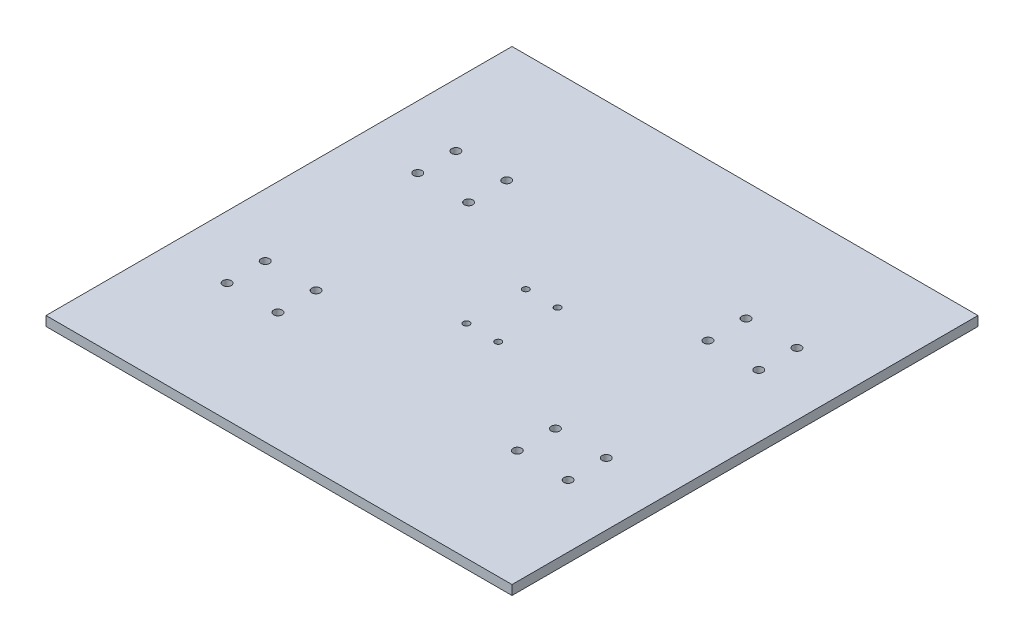
ISO-10303-21;
HEADER;
FILE_DESCRIPTION(('STEP AP214'),'2;1');
FILE_NAME('part.step','',(''),(''),'','','');
FILE_SCHEMA(('AUTOMOTIVE_DESIGN { 1 0 10303 214 1 1 1 1 }'));
ENDSEC;
DATA;
#1=APPLICATION_CONTEXT('core data for automotive mechanical design processes');
#2=APPLICATION_PROTOCOL_DEFINITION('international standard','automotive_design',2000,#1);
#3=PRODUCT_CONTEXT('',#1,'mechanical');
#4=PRODUCT('Part','Part','',(#3));
#5=PRODUCT_RELATED_PRODUCT_CATEGORY('part','',(#4));
#6=PRODUCT_DEFINITION_FORMATION('','',#4);
#7=PRODUCT_DEFINITION_CONTEXT('part definition',#1,'design');
#8=PRODUCT_DEFINITION('design','',#6,#7);
#9=PRODUCT_DEFINITION_SHAPE('','',#8);
#10=(LENGTH_UNIT() NAMED_UNIT(*) SI_UNIT(.MILLI.,.METRE.));
#11=(NAMED_UNIT(*) PLANE_ANGLE_UNIT() SI_UNIT($,.RADIAN.));
#12=(NAMED_UNIT(*) SI_UNIT($,.STERADIAN.) SOLID_ANGLE_UNIT());
#13=UNCERTAINTY_MEASURE_WITH_UNIT(LENGTH_MEASURE(1.E-05),#10,'distance_accuracy_value','');
#14=(GEOMETRIC_REPRESENTATION_CONTEXT(3) GLOBAL_UNCERTAINTY_ASSIGNED_CONTEXT((#13)) GLOBAL_UNIT_ASSIGNED_CONTEXT((#10,
#11,#12)) REPRESENTATION_CONTEXT('',''));
#15=CARTESIAN_POINT('',(0.,0.,0.));
#16=DIRECTION('',(0.,0.,1.));
#17=DIRECTION('',(1.,0.,0.));
#18=AXIS2_PLACEMENT_3D('',#15,#16,#17);
#19=CARTESIAN_POINT('',(0.,4.5,0.));
#20=DIRECTION('',(0.,1.,0.));
#21=DIRECTION('',(0.,0.,1.));
#22=AXIS2_PLACEMENT_3D('',#19,#20,#21);
#23=PLANE('',#22);
#24=CARTESIAN_POINT('',(56.5,4.5,-54.));
#25=DIRECTION('',(0.,1.,0.));
#26=DIRECTION('',(0.,0.,1.));
#27=AXIS2_PLACEMENT_3D('',#24,#25,#26);
#28=CIRCLE('',#27,2.);
#29=CARTESIAN_POINT('',(56.5,4.5,-52.));
#30=VERTEX_POINT('',#29);
#31=EDGE_CURVE('E220',#30,#30,#28,.F.);
#32=ORIENTED_EDGE('',*,*,#31,.T.);
#33=EDGE_LOOP('',(#32));
#34=FACE_BOUND('',#33,.T.);
#35=CARTESIAN_POINT('',(80.5,4.5,-54.));
#36=DIRECTION('',(0.,1.,0.));
#37=DIRECTION('',(0.,0.,1.));
#38=AXIS2_PLACEMENT_3D('',#35,#36,#37);
#39=CIRCLE('',#38,2.);
#40=CARTESIAN_POINT('',(80.5,4.5,-52.));
#41=VERTEX_POINT('',#40);
#42=EDGE_CURVE('E214',#41,#41,#39,.T.);
#43=ORIENTED_EDGE('',*,*,#42,.F.);
#44=EDGE_LOOP('',(#43));
#45=FACE_BOUND('',#44,.T.);
#46=CARTESIAN_POINT('',(80.5,4.5,-36.));
#47=DIRECTION('',(0.,1.,0.));
#48=DIRECTION('',(0.,0.,1.));
#49=AXIS2_PLACEMENT_3D('',#46,#47,#48);
#50=CIRCLE('',#49,2.);
#51=CARTESIAN_POINT('',(80.5,4.5,-34.));
#52=VERTEX_POINT('',#51);
#53=EDGE_CURVE('E208',#52,#52,#50,.T.);
#54=ORIENTED_EDGE('',*,*,#53,.F.);
#55=EDGE_LOOP('',(#54));
#56=FACE_BOUND('',#55,.T.);
#57=CARTESIAN_POINT('',(80.5,4.5,36.));
#58=DIRECTION('',(0.,1.,0.));
#59=DIRECTION('',(0.,0.,1.));
#60=AXIS2_PLACEMENT_3D('',#57,#58,#59);
#61=CIRCLE('',#60,1.99999999999999);
#62=CARTESIAN_POINT('',(80.5,4.5,38.));
#63=VERTEX_POINT('',#62);
#64=EDGE_CURVE('E202',#63,#63,#61,.T.);
#65=ORIENTED_EDGE('',*,*,#64,.F.);
#66=EDGE_LOOP('',(#65));
#67=FACE_BOUND('',#66,.T.);
#68=CARTESIAN_POINT('',(80.5,4.5,54.));
#69=DIRECTION('',(0.,1.,0.));
#70=DIRECTION('',(0.,0.,1.));
#71=AXIS2_PLACEMENT_3D('',#68,#69,#70);
#72=CIRCLE('',#71,1.99999999999999);
#73=CARTESIAN_POINT('',(80.5,4.5,56.));
#74=VERTEX_POINT('',#73);
#75=EDGE_CURVE('E196',#74,#74,#72,.T.);
#76=ORIENTED_EDGE('',*,*,#75,.F.);
#77=EDGE_LOOP('',(#76));
#78=FACE_BOUND('',#77,.T.);
#79=CARTESIAN_POINT('',(56.5,4.5,36.));
#80=DIRECTION('',(0.,1.,0.));
#81=DIRECTION('',(0.,0.,1.));
#82=AXIS2_PLACEMENT_3D('',#79,#80,#81);
#83=CIRCLE('',#82,2.);
#84=CARTESIAN_POINT('',(56.5,4.5,38.));
#85=VERTEX_POINT('',#84);
#86=EDGE_CURVE('E184',#85,#85,#83,.F.);
#87=ORIENTED_EDGE('',*,*,#86,.T.);
#88=EDGE_LOOP('',(#87));
#89=FACE_BOUND('',#88,.T.);
#90=CARTESIAN_POINT('',(-80.5,4.5,54.));
#91=DIRECTION('',(0.,1.,0.));
#92=DIRECTION('',(0.,0.,1.));
#93=AXIS2_PLACEMENT_3D('',#90,#91,#92);
#94=CIRCLE('',#93,1.99999999999999);
#95=CARTESIAN_POINT('',(-80.5,4.5,56.));
#96=VERTEX_POINT('',#95);
#97=EDGE_CURVE('E172',#96,#96,#94,.F.);
#98=ORIENTED_EDGE('',*,*,#97,.T.);
#99=EDGE_LOOP('',(#98));
#100=FACE_BOUND('',#99,.T.);
#101=CARTESIAN_POINT('',(-56.5000000000001,4.5,54.));
#102=DIRECTION('',(0.,1.,0.));
#103=DIRECTION('',(0.,0.,1.));
#104=AXIS2_PLACEMENT_3D('',#101,#102,#103);
#105=CIRCLE('',#104,2.);
#106=CARTESIAN_POINT('',(-56.5000000000001,4.5,56.));
#107=VERTEX_POINT('',#106);
#108=EDGE_CURVE('E166',#107,#107,#105,.T.);
#109=ORIENTED_EDGE('',*,*,#108,.F.);
#110=EDGE_LOOP('',(#109));
#111=FACE_BOUND('',#110,.T.);
#112=CARTESIAN_POINT('',(-56.5000000000001,4.5,36.));
#113=DIRECTION('',(0.,1.,0.));
#114=DIRECTION('',(0.,0.,1.));
#115=AXIS2_PLACEMENT_3D('',#112,#113,#114);
#116=CIRCLE('',#115,1.99999999999999);
#117=CARTESIAN_POINT('',(-56.5000000000001,4.5,38.));
#118=VERTEX_POINT('',#117);
#119=EDGE_CURVE('E160',#118,#118,#116,.T.);
#120=ORIENTED_EDGE('',*,*,#119,.F.);
#121=EDGE_LOOP('',(#120));
#122=FACE_BOUND('',#121,.T.);
#123=CARTESIAN_POINT('',(-56.5000000000001,4.5,-54.));
#124=DIRECTION('',(0.,1.,0.));
#125=DIRECTION('',(0.,0.,1.));
#126=AXIS2_PLACEMENT_3D('',#123,#124,#125);
#127=CIRCLE('',#126,2.);
#128=CARTESIAN_POINT('',(-56.5000000000001,4.5,-52.));
#129=VERTEX_POINT('',#128);
#130=EDGE_CURVE('E154',#129,#129,#127,.T.);
#131=ORIENTED_EDGE('',*,*,#130,.F.);
#132=EDGE_LOOP('',(#131));
#133=FACE_BOUND('',#132,.T.);
#134=CARTESIAN_POINT('',(-56.5000000000001,4.5,-36.));
#135=DIRECTION('',(0.,1.,0.));
#136=DIRECTION('',(0.,0.,1.));
#137=AXIS2_PLACEMENT_3D('',#134,#135,#136);
#138=CIRCLE('',#137,2.);
#139=CARTESIAN_POINT('',(-56.5000000000001,4.5,-34.));
#140=VERTEX_POINT('',#139);
#141=EDGE_CURVE('E148',#140,#140,#138,.T.);
#142=ORIENTED_EDGE('',*,*,#141,.F.);
#143=EDGE_LOOP('',(#142));
#144=FACE_BOUND('',#143,.T.);
#145=CARTESIAN_POINT('',(-80.5000000000001,4.5,-54.));
#146=DIRECTION('',(0.,1.,0.));
#147=DIRECTION('',(0.,0.,1.));
#148=AXIS2_PLACEMENT_3D('',#145,#146,#147);
#149=CIRCLE('',#148,2.);
#150=CARTESIAN_POINT('',(-80.5000000000001,4.5,-52.));
#151=VERTEX_POINT('',#150);
#152=EDGE_CURVE('E136',#151,#151,#149,.F.);
#153=ORIENTED_EDGE('',*,*,#152,.T.);
#154=EDGE_LOOP('',(#153));
#155=FACE_BOUND('',#154,.T.);
#156=CARTESIAN_POINT('',(7.50000000000001,4.5,-14.));
#157=DIRECTION('',(0.,1.,0.));
#158=DIRECTION('',(0.,0.,1.));
#159=AXIS2_PLACEMENT_3D('',#156,#157,#158);
#160=CIRCLE('',#159,1.5);
#161=CARTESIAN_POINT('',(7.50000000000001,4.5,-12.5));
#162=VERTEX_POINT('',#161);
#163=EDGE_CURVE('E118',#162,#162,#160,.F.);
#164=ORIENTED_EDGE('',*,*,#163,.T.);
#165=EDGE_LOOP('',(#164));
#166=FACE_BOUND('',#165,.T.);
#167=CARTESIAN_POINT('',(-7.49999999999999,4.5,-14.));
#168=DIRECTION('',(0.,1.,0.));
#169=DIRECTION('',(0.,0.,1.));
#170=AXIS2_PLACEMENT_3D('',#167,#168,#169);
#171=CIRCLE('',#170,1.5);
#172=CARTESIAN_POINT('',(-7.49999999999999,4.5,-12.5));
#173=VERTEX_POINT('',#172);
#174=EDGE_CURVE('E112',#173,#173,#171,.T.);
#175=ORIENTED_EDGE('',*,*,#174,.F.);
#176=EDGE_LOOP('',(#175));
#177=FACE_BOUND('',#176,.T.);
#178=DIRECTION('',(0.,0.,-1.));
#179=VECTOR('',#178,1.);
#180=CARTESIAN_POINT('',(110.,4.5,-110.));
#181=LINE('',#180,#179);
#182=CARTESIAN_POINT('',(110.,4.5,110.));
#183=VERTEX_POINT('',#182);
#184=CARTESIAN_POINT('',(110.,4.5,-110.));
#185=VERTEX_POINT('',#184);
#186=EDGE_CURVE('E85',#183,#185,#181,.T.);
#187=ORIENTED_EDGE('',*,*,#186,.T.);
#188=DIRECTION('',(-1.,0.,0.));
#189=VECTOR('',#188,1.);
#190=CARTESIAN_POINT('',(-110.,4.5,-110.));
#191=LINE('',#190,#189);
#192=CARTESIAN_POINT('',(-110.,4.5,-110.));
#193=VERTEX_POINT('',#192);
#194=EDGE_CURVE('E80',#185,#193,#191,.T.);
#195=ORIENTED_EDGE('',*,*,#194,.T.);
#196=DIRECTION('',(0.,0.,1.));
#197=VECTOR('',#196,1.);
#198=CARTESIAN_POINT('',(-110.,4.5,-110.));
#199=LINE('',#198,#197);
#200=CARTESIAN_POINT('',(-110.,4.5,110.));
#201=VERTEX_POINT('',#200);
#202=EDGE_CURVE('E83',#193,#201,#199,.T.);
#203=ORIENTED_EDGE('',*,*,#202,.T.);
#204=DIRECTION('',(1.,0.,0.));
#205=VECTOR('',#204,1.);
#206=CARTESIAN_POINT('',(-110.,4.5,110.));
#207=LINE('',#206,#205);
#208=EDGE_CURVE('E50',#201,#183,#207,.T.);
#209=ORIENTED_EDGE('',*,*,#208,.T.);
#210=EDGE_LOOP('',(#187,#195,#203,#209));
#211=FACE_BOUND('',#210,.T.);
#212=CARTESIAN_POINT('',(7.50000000000001,4.5,14.));
#213=DIRECTION('',(0.,1.,0.));
#214=DIRECTION('',(0.,0.,1.));
#215=AXIS2_PLACEMENT_3D('',#212,#213,#214);
#216=CIRCLE('',#215,1.5);
#217=CARTESIAN_POINT('',(7.50000000000001,4.5,15.5));
#218=VERTEX_POINT('',#217);
#219=EDGE_CURVE('E124',#218,#218,#216,.T.);
#220=ORIENTED_EDGE('',*,*,#219,.F.);
#221=EDGE_LOOP('',(#220));
#222=FACE_BOUND('',#221,.T.);
#223=CARTESIAN_POINT('',(-7.49999999999998,4.5,14.));
#224=DIRECTION('',(0.,1.,0.));
#225=DIRECTION('',(0.,0.,1.));
#226=AXIS2_PLACEMENT_3D('',#223,#224,#225);
#227=CIRCLE('',#226,1.5);
#228=CARTESIAN_POINT('',(-7.49999999999998,4.5,15.5));
#229=VERTEX_POINT('',#228);
#230=EDGE_CURVE('E130',#229,#229,#227,.F.);
#231=ORIENTED_EDGE('',*,*,#230,.T.);
#232=EDGE_LOOP('',(#231));
#233=FACE_BOUND('',#232,.T.);
#234=CARTESIAN_POINT('',(-80.5000000000001,4.5,-36.));
#235=DIRECTION('',(0.,1.,0.));
#236=DIRECTION('',(0.,0.,1.));
#237=AXIS2_PLACEMENT_3D('',#234,#235,#236);
#238=CIRCLE('',#237,2.);
#239=CARTESIAN_POINT('',(-80.5000000000001,4.5,-34.));
#240=VERTEX_POINT('',#239);
#241=EDGE_CURVE('E142',#240,#240,#238,.F.);
#242=ORIENTED_EDGE('',*,*,#241,.T.);
#243=EDGE_LOOP('',(#242));
#244=FACE_BOUND('',#243,.T.);
#245=CARTESIAN_POINT('',(-80.5000000000001,4.5,36.));
#246=DIRECTION('',(0.,1.,0.));
#247=DIRECTION('',(0.,0.,1.));
#248=AXIS2_PLACEMENT_3D('',#245,#246,#247);
#249=CIRCLE('',#248,1.99999999999999);
#250=CARTESIAN_POINT('',(-80.5000000000001,4.5,38.));
#251=VERTEX_POINT('',#250);
#252=EDGE_CURVE('E178',#251,#251,#249,.F.);
#253=ORIENTED_EDGE('',*,*,#252,.T.);
#254=EDGE_LOOP('',(#253));
#255=FACE_BOUND('',#254,.T.);
#256=CARTESIAN_POINT('',(56.5,4.5,54.));
#257=DIRECTION('',(0.,1.,0.));
#258=DIRECTION('',(0.,0.,1.));
#259=AXIS2_PLACEMENT_3D('',#256,#257,#258);
#260=CIRCLE('',#259,1.99999999999999);
#261=CARTESIAN_POINT('',(56.5,4.5,56.));
#262=VERTEX_POINT('',#261);
#263=EDGE_CURVE('E190',#262,#262,#260,.F.);
#264=ORIENTED_EDGE('',*,*,#263,.T.);
#265=EDGE_LOOP('',(#264));
#266=FACE_BOUND('',#265,.T.);
#267=CARTESIAN_POINT('',(56.5,4.5,-36.));
#268=DIRECTION('',(0.,1.,0.));
#269=DIRECTION('',(0.,0.,1.));
#270=AXIS2_PLACEMENT_3D('',#267,#268,#269);
#271=CIRCLE('',#270,2.);
#272=CARTESIAN_POINT('',(56.5,4.5,-34.));
#273=VERTEX_POINT('',#272);
#274=EDGE_CURVE('E226',#273,#273,#271,.F.);
#275=ORIENTED_EDGE('',*,*,#274,.T.);
#276=EDGE_LOOP('',(#275));
#277=FACE_BOUND('',#276,.T.);
#278=ADVANCED_FACE('F33',(#34,#45,#56,#67,#78,#89,#100,#111,#122,#133,#144,#155,#166,#177,#211,
#222,#233,#244,#255,#266,#277),#23,.T.);
#279=CARTESIAN_POINT('',(0.,0.,0.));
#280=DIRECTION('',(0.,1.,0.));
#281=DIRECTION('',(0.,0.,1.));
#282=AXIS2_PLACEMENT_3D('',#279,#280,#281);
#283=PLANE('',#282);
#284=CARTESIAN_POINT('',(56.5,0.,-54.));
#285=DIRECTION('',(0.,1.,0.));
#286=DIRECTION('',(0.,0.,1.));
#287=AXIS2_PLACEMENT_3D('',#284,#285,#286);
#288=CIRCLE('',#287,2.);
#289=CARTESIAN_POINT('',(56.5,0.,-52.));
#290=VERTEX_POINT('',#289);
#291=EDGE_CURVE('E217',#290,#290,#288,.F.);
#292=ORIENTED_EDGE('',*,*,#291,.F.);
#293=EDGE_LOOP('',(#292));
#294=FACE_BOUND('',#293,.T.);
#295=CARTESIAN_POINT('',(80.5,0.,-54.));
#296=DIRECTION('',(0.,1.,0.));
#297=DIRECTION('',(0.,0.,1.));
#298=AXIS2_PLACEMENT_3D('',#295,#296,#297);
#299=CIRCLE('',#298,2.);
#300=CARTESIAN_POINT('',(80.5,0.,-52.));
#301=VERTEX_POINT('',#300);
#302=EDGE_CURVE('E211',#301,#301,#299,.T.);
#303=ORIENTED_EDGE('',*,*,#302,.T.);
#304=EDGE_LOOP('',(#303));
#305=FACE_BOUND('',#304,.T.);
#306=CARTESIAN_POINT('',(80.5,0.,-36.));
#307=DIRECTION('',(0.,1.,0.));
#308=DIRECTION('',(0.,0.,1.));
#309=AXIS2_PLACEMENT_3D('',#306,#307,#308);
#310=CIRCLE('',#309,2.);
#311=CARTESIAN_POINT('',(80.5,0.,-34.));
#312=VERTEX_POINT('',#311);
#313=EDGE_CURVE('E205',#312,#312,#310,.T.);
#314=ORIENTED_EDGE('',*,*,#313,.T.);
#315=EDGE_LOOP('',(#314));
#316=FACE_BOUND('',#315,.T.);
#317=CARTESIAN_POINT('',(80.5,0.,36.));
#318=DIRECTION('',(0.,1.,0.));
#319=DIRECTION('',(0.,0.,1.));
#320=AXIS2_PLACEMENT_3D('',#317,#318,#319);
#321=CIRCLE('',#320,1.99999999999999);
#322=CARTESIAN_POINT('',(80.5,0.,38.));
#323=VERTEX_POINT('',#322);
#324=EDGE_CURVE('E199',#323,#323,#321,.T.);
#325=ORIENTED_EDGE('',*,*,#324,.T.);
#326=EDGE_LOOP('',(#325));
#327=FACE_BOUND('',#326,.T.);
#328=CARTESIAN_POINT('',(80.5,0.,54.));
#329=DIRECTION('',(0.,1.,0.));
#330=DIRECTION('',(0.,0.,1.));
#331=AXIS2_PLACEMENT_3D('',#328,#329,#330);
#332=CIRCLE('',#331,1.99999999999999);
#333=CARTESIAN_POINT('',(80.5,0.,56.));
#334=VERTEX_POINT('',#333);
#335=EDGE_CURVE('E193',#334,#334,#332,.T.);
#336=ORIENTED_EDGE('',*,*,#335,.T.);
#337=EDGE_LOOP('',(#336));
#338=FACE_BOUND('',#337,.T.);
#339=CARTESIAN_POINT('',(56.5,0.,36.));
#340=DIRECTION('',(0.,1.,0.));
#341=DIRECTION('',(0.,0.,1.));
#342=AXIS2_PLACEMENT_3D('',#339,#340,#341);
#343=CIRCLE('',#342,2.);
#344=CARTESIAN_POINT('',(56.5,0.,38.));
#345=VERTEX_POINT('',#344);
#346=EDGE_CURVE('E181',#345,#345,#343,.F.);
#347=ORIENTED_EDGE('',*,*,#346,.F.);
#348=EDGE_LOOP('',(#347));
#349=FACE_BOUND('',#348,.T.);
#350=CARTESIAN_POINT('',(-80.5,0.,54.));
#351=DIRECTION('',(0.,1.,0.));
#352=DIRECTION('',(0.,0.,1.));
#353=AXIS2_PLACEMENT_3D('',#350,#351,#352);
#354=CIRCLE('',#353,1.99999999999999);
#355=CARTESIAN_POINT('',(-80.5,0.,56.));
#356=VERTEX_POINT('',#355);
#357=EDGE_CURVE('E169',#356,#356,#354,.F.);
#358=ORIENTED_EDGE('',*,*,#357,.F.);
#359=EDGE_LOOP('',(#358));
#360=FACE_BOUND('',#359,.T.);
#361=CARTESIAN_POINT('',(-56.5000000000001,0.,54.));
#362=DIRECTION('',(0.,1.,0.));
#363=DIRECTION('',(0.,0.,1.));
#364=AXIS2_PLACEMENT_3D('',#361,#362,#363);
#365=CIRCLE('',#364,2.);
#366=CARTESIAN_POINT('',(-56.5000000000001,0.,56.));
#367=VERTEX_POINT('',#366);
#368=EDGE_CURVE('E163',#367,#367,#365,.T.);
#369=ORIENTED_EDGE('',*,*,#368,.T.);
#370=EDGE_LOOP('',(#369));
#371=FACE_BOUND('',#370,.T.);
#372=CARTESIAN_POINT('',(-56.5000000000001,0.,36.));
#373=DIRECTION('',(0.,1.,0.));
#374=DIRECTION('',(0.,0.,1.));
#375=AXIS2_PLACEMENT_3D('',#372,#373,#374);
#376=CIRCLE('',#375,1.99999999999999);
#377=CARTESIAN_POINT('',(-56.5000000000001,0.,38.));
#378=VERTEX_POINT('',#377);
#379=EDGE_CURVE('E157',#378,#378,#376,.T.);
#380=ORIENTED_EDGE('',*,*,#379,.T.);
#381=EDGE_LOOP('',(#380));
#382=FACE_BOUND('',#381,.T.);
#383=CARTESIAN_POINT('',(-56.5000000000001,0.,-54.));
#384=DIRECTION('',(0.,1.,0.));
#385=DIRECTION('',(0.,0.,1.));
#386=AXIS2_PLACEMENT_3D('',#383,#384,#385);
#387=CIRCLE('',#386,2.);
#388=CARTESIAN_POINT('',(-56.5000000000001,0.,-52.));
#389=VERTEX_POINT('',#388);
#390=EDGE_CURVE('E151',#389,#389,#387,.T.);
#391=ORIENTED_EDGE('',*,*,#390,.T.);
#392=EDGE_LOOP('',(#391));
#393=FACE_BOUND('',#392,.T.);
#394=CARTESIAN_POINT('',(-56.5000000000001,0.,-36.));
#395=DIRECTION('',(0.,1.,0.));
#396=DIRECTION('',(0.,0.,1.));
#397=AXIS2_PLACEMENT_3D('',#394,#395,#396);
#398=CIRCLE('',#397,2.);
#399=CARTESIAN_POINT('',(-56.5000000000001,0.,-34.));
#400=VERTEX_POINT('',#399);
#401=EDGE_CURVE('E145',#400,#400,#398,.T.);
#402=ORIENTED_EDGE('',*,*,#401,.T.);
#403=EDGE_LOOP('',(#402));
#404=FACE_BOUND('',#403,.T.);
#405=CARTESIAN_POINT('',(-80.5000000000001,0.,-54.));
#406=DIRECTION('',(0.,1.,0.));
#407=DIRECTION('',(0.,0.,1.));
#408=AXIS2_PLACEMENT_3D('',#405,#406,#407);
#409=CIRCLE('',#408,2.);
#410=CARTESIAN_POINT('',(-80.5000000000001,0.,-52.));
#411=VERTEX_POINT('',#410);
#412=EDGE_CURVE('E133',#411,#411,#409,.F.);
#413=ORIENTED_EDGE('',*,*,#412,.F.);
#414=EDGE_LOOP('',(#413));
#415=FACE_BOUND('',#414,.T.);
#416=CARTESIAN_POINT('',(7.50000000000001,0.,-14.));
#417=DIRECTION('',(0.,1.,0.));
#418=DIRECTION('',(0.,0.,1.));
#419=AXIS2_PLACEMENT_3D('',#416,#417,#418);
#420=CIRCLE('',#419,1.5);
#421=CARTESIAN_POINT('',(7.50000000000001,0.,-12.5));
#422=VERTEX_POINT('',#421);
#423=EDGE_CURVE('E115',#422,#422,#420,.F.);
#424=ORIENTED_EDGE('',*,*,#423,.F.);
#425=EDGE_LOOP('',(#424));
#426=FACE_BOUND('',#425,.T.);
#427=CARTESIAN_POINT('',(-7.49999999999999,0.,-14.));
#428=DIRECTION('',(0.,1.,0.));
#429=DIRECTION('',(0.,0.,1.));
#430=AXIS2_PLACEMENT_3D('',#427,#428,#429);
#431=CIRCLE('',#430,1.5);
#432=CARTESIAN_POINT('',(-7.49999999999999,0.,-12.5));
#433=VERTEX_POINT('',#432);
#434=EDGE_CURVE('E100',#433,#433,#431,.T.);
#435=ORIENTED_EDGE('',*,*,#434,.T.);
#436=EDGE_LOOP('',(#435));
#437=FACE_BOUND('',#436,.T.);
#438=DIRECTION('',(0.,0.,-1.));
#439=VECTOR('',#438,1.);
#440=CARTESIAN_POINT('',(110.,0.,-110.));
#441=LINE('',#440,#439);
#442=CARTESIAN_POINT('',(110.,0.,110.));
#443=VERTEX_POINT('',#442);
#444=CARTESIAN_POINT('',(110.,0.,-110.));
#445=VERTEX_POINT('',#444);
#446=EDGE_CURVE('E97',#443,#445,#441,.T.);
#447=ORIENTED_EDGE('',*,*,#446,.F.);
#448=DIRECTION('',(1.,0.,0.));
#449=VECTOR('',#448,1.);
#450=CARTESIAN_POINT('',(-110.,0.,110.));
#451=LINE('',#450,#449);
#452=CARTESIAN_POINT('',(-110.,0.,110.));
#453=VERTEX_POINT('',#452);
#454=EDGE_CURVE('E73',#453,#443,#451,.T.);
#455=ORIENTED_EDGE('',*,*,#454,.F.);
#456=DIRECTION('',(0.,0.,1.));
#457=VECTOR('',#456,1.);
#458=CARTESIAN_POINT('',(-110.,0.,-110.));
#459=LINE('',#458,#457);
#460=CARTESIAN_POINT('',(-110.,0.,-110.));
#461=VERTEX_POINT('',#460);
#462=EDGE_CURVE('E67',#461,#453,#459,.T.);
#463=ORIENTED_EDGE('',*,*,#462,.F.);
#464=DIRECTION('',(-1.,0.,0.));
#465=VECTOR('',#464,1.);
#466=CARTESIAN_POINT('',(-110.,0.,-110.));
#467=LINE('',#466,#465);
#468=EDGE_CURVE('E89',#445,#461,#467,.T.);
#469=ORIENTED_EDGE('',*,*,#468,.F.);
#470=EDGE_LOOP('',(#447,#455,#463,#469));
#471=FACE_BOUND('',#470,.T.);
#472=CARTESIAN_POINT('',(7.50000000000001,0.,14.));
#473=DIRECTION('',(0.,1.,0.));
#474=DIRECTION('',(0.,0.,1.));
#475=AXIS2_PLACEMENT_3D('',#472,#473,#474);
#476=CIRCLE('',#475,1.5);
#477=CARTESIAN_POINT('',(7.50000000000001,0.,15.5));
#478=VERTEX_POINT('',#477);
#479=EDGE_CURVE('E121',#478,#478,#476,.T.);
#480=ORIENTED_EDGE('',*,*,#479,.T.);
#481=EDGE_LOOP('',(#480));
#482=FACE_BOUND('',#481,.T.);
#483=CARTESIAN_POINT('',(-7.49999999999998,0.,14.));
#484=DIRECTION('',(0.,1.,0.));
#485=DIRECTION('',(0.,0.,1.));
#486=AXIS2_PLACEMENT_3D('',#483,#484,#485);
#487=CIRCLE('',#486,1.5);
#488=CARTESIAN_POINT('',(-7.49999999999998,0.,15.5));
#489=VERTEX_POINT('',#488);
#490=EDGE_CURVE('E127',#489,#489,#487,.F.);
#491=ORIENTED_EDGE('',*,*,#490,.F.);
#492=EDGE_LOOP('',(#491));
#493=FACE_BOUND('',#492,.T.);
#494=CARTESIAN_POINT('',(-80.5000000000001,0.,-36.));
#495=DIRECTION('',(0.,1.,0.));
#496=DIRECTION('',(0.,0.,1.));
#497=AXIS2_PLACEMENT_3D('',#494,#495,#496);
#498=CIRCLE('',#497,2.);
#499=CARTESIAN_POINT('',(-80.5000000000001,0.,-34.));
#500=VERTEX_POINT('',#499);
#501=EDGE_CURVE('E139',#500,#500,#498,.F.);
#502=ORIENTED_EDGE('',*,*,#501,.F.);
#503=EDGE_LOOP('',(#502));
#504=FACE_BOUND('',#503,.T.);
#505=CARTESIAN_POINT('',(-80.5000000000001,0.,36.));
#506=DIRECTION('',(0.,1.,0.));
#507=DIRECTION('',(0.,0.,1.));
#508=AXIS2_PLACEMENT_3D('',#505,#506,#507);
#509=CIRCLE('',#508,1.99999999999999);
#510=CARTESIAN_POINT('',(-80.5000000000001,0.,38.));
#511=VERTEX_POINT('',#510);
#512=EDGE_CURVE('E175',#511,#511,#509,.F.);
#513=ORIENTED_EDGE('',*,*,#512,.F.);
#514=EDGE_LOOP('',(#513));
#515=FACE_BOUND('',#514,.T.);
#516=CARTESIAN_POINT('',(56.5,0.,54.));
#517=DIRECTION('',(0.,1.,0.));
#518=DIRECTION('',(0.,0.,1.));
#519=AXIS2_PLACEMENT_3D('',#516,#517,#518);
#520=CIRCLE('',#519,1.99999999999999);
#521=CARTESIAN_POINT('',(56.5,0.,56.));
#522=VERTEX_POINT('',#521);
#523=EDGE_CURVE('E187',#522,#522,#520,.F.);
#524=ORIENTED_EDGE('',*,*,#523,.F.);
#525=EDGE_LOOP('',(#524));
#526=FACE_BOUND('',#525,.T.);
#527=CARTESIAN_POINT('',(56.5,0.,-36.));
#528=DIRECTION('',(0.,1.,0.));
#529=DIRECTION('',(0.,0.,1.));
#530=AXIS2_PLACEMENT_3D('',#527,#528,#529);
#531=CIRCLE('',#530,2.);
#532=CARTESIAN_POINT('',(56.5,0.,-34.));
#533=VERTEX_POINT('',#532);
#534=EDGE_CURVE('E223',#533,#533,#531,.F.);
#535=ORIENTED_EDGE('',*,*,#534,.F.);
#536=EDGE_LOOP('',(#535));
#537=FACE_BOUND('',#536,.T.);
#538=ADVANCED_FACE('F108',(#294,#305,#316,#327,#338,#349,#360,#371,#382,#393,#404,#415,#426,
#437,#471,#482,#493,#504,#515,#526,#537),#283,.F.);
#539=CARTESIAN_POINT('',(110.,4.5,-110.));
#540=DIRECTION('',(-1.,0.,0.));
#541=DIRECTION('',(0.,0.,1.));
#542=AXIS2_PLACEMENT_3D('',#539,#540,#541);
#543=PLANE('',#542);
#544=ORIENTED_EDGE('',*,*,#446,.T.);
#545=DIRECTION('',(0.,-1.,0.));
#546=VECTOR('',#545,1.);
#547=CARTESIAN_POINT('',(110.,4.5,-110.));
#548=LINE('',#547,#546);
#549=EDGE_CURVE('E11',#185,#445,#548,.T.);
#550=ORIENTED_EDGE('',*,*,#549,.F.);
#551=ORIENTED_EDGE('',*,*,#186,.F.);
#552=DIRECTION('',(0.,-1.,0.));
#553=VECTOR('',#552,1.);
#554=CARTESIAN_POINT('',(110.,4.5,110.));
#555=LINE('',#554,#553);
#556=EDGE_CURVE('E93',#183,#443,#555,.T.);
#557=ORIENTED_EDGE('',*,*,#556,.T.);
#558=EDGE_LOOP('',(#544,#550,#551,#557));
#559=FACE_BOUND('',#558,.T.);
#560=ADVANCED_FACE('F35',(#559),#543,.F.);
#561=CARTESIAN_POINT('',(-110.,4.5,-110.));
#562=DIRECTION('',(0.,0.,1.));
#563=DIRECTION('',(1.,0.,0.));
#564=AXIS2_PLACEMENT_3D('',#561,#562,#563);
#565=PLANE('',#564);
#566=ORIENTED_EDGE('',*,*,#468,.T.);
#567=DIRECTION('',(0.,-1.,0.));
#568=VECTOR('',#567,1.);
#569=CARTESIAN_POINT('',(-110.,4.5,-110.));
#570=LINE('',#569,#568);
#571=EDGE_CURVE('E42',#193,#461,#570,.T.);
#572=ORIENTED_EDGE('',*,*,#571,.F.);
#573=ORIENTED_EDGE('',*,*,#194,.F.);
#574=ORIENTED_EDGE('',*,*,#549,.T.);
#575=EDGE_LOOP('',(#566,#572,#573,#574));
#576=FACE_BOUND('',#575,.T.);
#577=ADVANCED_FACE('F88',(#576),#565,.F.);
#578=CARTESIAN_POINT('',(-110.,4.5,-110.));
#579=DIRECTION('',(1.,0.,0.));
#580=DIRECTION('',(0.,0.,-1.));
#581=AXIS2_PLACEMENT_3D('',#578,#579,#580);
#582=PLANE('',#581);
#583=ORIENTED_EDGE('',*,*,#462,.T.);
#584=DIRECTION('',(0.,-1.,0.));
#585=VECTOR('',#584,1.);
#586=CARTESIAN_POINT('',(-110.,4.5,110.));
#587=LINE('',#586,#585);
#588=EDGE_CURVE('E90',#201,#453,#587,.T.);
#589=ORIENTED_EDGE('',*,*,#588,.F.);
#590=ORIENTED_EDGE('',*,*,#202,.F.);
#591=ORIENTED_EDGE('',*,*,#571,.T.);
#592=EDGE_LOOP('',(#583,#589,#590,#591));
#593=FACE_BOUND('',#592,.T.);
#594=ADVANCED_FACE('F91',(#593),#582,.F.);
#595=CARTESIAN_POINT('',(-110.,4.5,110.));
#596=DIRECTION('',(0.,0.,-1.));
#597=DIRECTION('',(-1.,0.,0.));
#598=AXIS2_PLACEMENT_3D('',#595,#596,#597);
#599=PLANE('',#598);
#600=ORIENTED_EDGE('',*,*,#454,.T.);
#601=ORIENTED_EDGE('',*,*,#556,.F.);
#602=ORIENTED_EDGE('',*,*,#208,.F.);
#603=ORIENTED_EDGE('',*,*,#588,.T.);
#604=EDGE_LOOP('',(#600,#601,#602,#603));
#605=FACE_BOUND('',#604,.T.);
#606=ADVANCED_FACE('F105',(#605),#599,.F.);
#607=CARTESIAN_POINT('',(-7.49999999999999,0.,-14.));
#608=DIRECTION('',(0.,1.,0.));
#609=DIRECTION('',(0.,0.,1.));
#610=AXIS2_PLACEMENT_3D('',#607,#608,#609);
#611=CYLINDRICAL_SURFACE('',#610,1.5);
#612=ORIENTED_EDGE('',*,*,#434,.F.);
#613=EDGE_LOOP('',(#612));
#614=FACE_BOUND('',#613,.T.);
#615=ORIENTED_EDGE('',*,*,#174,.T.);
#616=EDGE_LOOP('',(#615));
#617=FACE_BOUND('',#616,.T.);
#618=ADVANCED_FACE('F250',(#614,#617),#611,.F.);
#619=CARTESIAN_POINT('',(7.50000000000001,0.,-14.));
#620=DIRECTION('',(0.,1.,0.));
#621=DIRECTION('',(0.,0.,1.));
#622=AXIS2_PLACEMENT_3D('',#619,#620,#621);
#623=CYLINDRICAL_SURFACE('',#622,1.5);
#624=ORIENTED_EDGE('',*,*,#423,.T.);
#625=EDGE_LOOP('',(#624));
#626=FACE_BOUND('',#625,.T.);
#627=ORIENTED_EDGE('',*,*,#163,.F.);
#628=EDGE_LOOP('',(#627));
#629=FACE_BOUND('',#628,.T.);
#630=ADVANCED_FACE('F272',(#626,#629),#623,.F.);
#631=CARTESIAN_POINT('',(7.50000000000001,0.,14.));
#632=DIRECTION('',(0.,1.,0.));
#633=DIRECTION('',(0.,0.,1.));
#634=AXIS2_PLACEMENT_3D('',#631,#632,#633);
#635=CYLINDRICAL_SURFACE('',#634,1.5);
#636=ORIENTED_EDGE('',*,*,#479,.F.);
#637=EDGE_LOOP('',(#636));
#638=FACE_BOUND('',#637,.T.);
#639=ORIENTED_EDGE('',*,*,#219,.T.);
#640=EDGE_LOOP('',(#639));
#641=FACE_BOUND('',#640,.T.);
#642=ADVANCED_FACE('F279',(#638,#641),#635,.F.);
#643=CARTESIAN_POINT('',(-7.49999999999998,0.,14.));
#644=DIRECTION('',(0.,1.,0.));
#645=DIRECTION('',(0.,0.,1.));
#646=AXIS2_PLACEMENT_3D('',#643,#644,#645);
#647=CYLINDRICAL_SURFACE('',#646,1.5);
#648=ORIENTED_EDGE('',*,*,#490,.T.);
#649=EDGE_LOOP('',(#648));
#650=FACE_BOUND('',#649,.T.);
#651=ORIENTED_EDGE('',*,*,#230,.F.);
#652=EDGE_LOOP('',(#651));
#653=FACE_BOUND('',#652,.T.);
#654=ADVANCED_FACE('F287',(#650,#653),#647,.F.);
#655=CARTESIAN_POINT('',(-80.5000000000001,0.,-54.));
#656=DIRECTION('',(0.,1.,0.));
#657=DIRECTION('',(0.,0.,1.));
#658=AXIS2_PLACEMENT_3D('',#655,#656,#657);
#659=CYLINDRICAL_SURFACE('',#658,2.);
#660=ORIENTED_EDGE('',*,*,#412,.T.);
#661=EDGE_LOOP('',(#660));
#662=FACE_BOUND('',#661,.T.);
#663=ORIENTED_EDGE('',*,*,#152,.F.);
#664=EDGE_LOOP('',(#663));
#665=FACE_BOUND('',#664,.T.);
#666=ADVANCED_FACE('F295',(#662,#665),#659,.F.);
#667=CARTESIAN_POINT('',(-80.5000000000001,0.,-36.));
#668=DIRECTION('',(0.,1.,0.));
#669=DIRECTION('',(0.,0.,1.));
#670=AXIS2_PLACEMENT_3D('',#667,#668,#669);
#671=CYLINDRICAL_SURFACE('',#670,2.);
#672=ORIENTED_EDGE('',*,*,#501,.T.);
#673=EDGE_LOOP('',(#672));
#674=FACE_BOUND('',#673,.T.);
#675=ORIENTED_EDGE('',*,*,#241,.F.);
#676=EDGE_LOOP('',(#675));
#677=FACE_BOUND('',#676,.T.);
#678=ADVANCED_FACE('F303',(#674,#677),#671,.F.);
#679=CARTESIAN_POINT('',(-56.5000000000001,0.,-36.));
#680=DIRECTION('',(0.,1.,0.));
#681=DIRECTION('',(0.,0.,1.));
#682=AXIS2_PLACEMENT_3D('',#679,#680,#681);
#683=CYLINDRICAL_SURFACE('',#682,2.);
#684=ORIENTED_EDGE('',*,*,#401,.F.);
#685=EDGE_LOOP('',(#684));
#686=FACE_BOUND('',#685,.T.);
#687=ORIENTED_EDGE('',*,*,#141,.T.);
#688=EDGE_LOOP('',(#687));
#689=FACE_BOUND('',#688,.T.);
#690=ADVANCED_FACE('F311',(#686,#689),#683,.F.);
#691=CARTESIAN_POINT('',(-56.5000000000001,0.,-54.));
#692=DIRECTION('',(0.,1.,0.));
#693=DIRECTION('',(0.,0.,1.));
#694=AXIS2_PLACEMENT_3D('',#691,#692,#693);
#695=CYLINDRICAL_SURFACE('',#694,2.);
#696=ORIENTED_EDGE('',*,*,#390,.F.);
#697=EDGE_LOOP('',(#696));
#698=FACE_BOUND('',#697,.T.);
#699=ORIENTED_EDGE('',*,*,#130,.T.);
#700=EDGE_LOOP('',(#699));
#701=FACE_BOUND('',#700,.T.);
#702=ADVANCED_FACE('F319',(#698,#701),#695,.F.);
#703=CARTESIAN_POINT('',(-56.5000000000001,0.,36.));
#704=DIRECTION('',(0.,1.,0.));
#705=DIRECTION('',(0.,0.,1.));
#706=AXIS2_PLACEMENT_3D('',#703,#704,#705);
#707=CYLINDRICAL_SURFACE('',#706,1.99999999999999);
#708=ORIENTED_EDGE('',*,*,#379,.F.);
#709=EDGE_LOOP('',(#708));
#710=FACE_BOUND('',#709,.T.);
#711=ORIENTED_EDGE('',*,*,#119,.T.);
#712=EDGE_LOOP('',(#711));
#713=FACE_BOUND('',#712,.T.);
#714=ADVANCED_FACE('F327',(#710,#713),#707,.F.);
#715=CARTESIAN_POINT('',(-56.5000000000001,0.,54.));
#716=DIRECTION('',(0.,1.,0.));
#717=DIRECTION('',(0.,0.,1.));
#718=AXIS2_PLACEMENT_3D('',#715,#716,#717);
#719=CYLINDRICAL_SURFACE('',#718,2.);
#720=ORIENTED_EDGE('',*,*,#368,.F.);
#721=EDGE_LOOP('',(#720));
#722=FACE_BOUND('',#721,.T.);
#723=ORIENTED_EDGE('',*,*,#108,.T.);
#724=EDGE_LOOP('',(#723));
#725=FACE_BOUND('',#724,.T.);
#726=ADVANCED_FACE('F335',(#722,#725),#719,.F.);
#727=CARTESIAN_POINT('',(-80.5,0.,54.));
#728=DIRECTION('',(0.,1.,0.));
#729=DIRECTION('',(0.,0.,1.));
#730=AXIS2_PLACEMENT_3D('',#727,#728,#729);
#731=CYLINDRICAL_SURFACE('',#730,1.99999999999999);
#732=ORIENTED_EDGE('',*,*,#357,.T.);
#733=EDGE_LOOP('',(#732));
#734=FACE_BOUND('',#733,.T.);
#735=ORIENTED_EDGE('',*,*,#97,.F.);
#736=EDGE_LOOP('',(#735));
#737=FACE_BOUND('',#736,.T.);
#738=ADVANCED_FACE('F343',(#734,#737),#731,.F.);
#739=CARTESIAN_POINT('',(-80.5000000000001,0.,36.));
#740=DIRECTION('',(0.,1.,0.));
#741=DIRECTION('',(0.,0.,1.));
#742=AXIS2_PLACEMENT_3D('',#739,#740,#741);
#743=CYLINDRICAL_SURFACE('',#742,1.99999999999999);
#744=ORIENTED_EDGE('',*,*,#512,.T.);
#745=EDGE_LOOP('',(#744));
#746=FACE_BOUND('',#745,.T.);
#747=ORIENTED_EDGE('',*,*,#252,.F.);
#748=EDGE_LOOP('',(#747));
#749=FACE_BOUND('',#748,.T.);
#750=ADVANCED_FACE('F351',(#746,#749),#743,.F.);
#751=CARTESIAN_POINT('',(56.5,0.,36.));
#752=DIRECTION('',(0.,1.,0.));
#753=DIRECTION('',(0.,0.,1.));
#754=AXIS2_PLACEMENT_3D('',#751,#752,#753);
#755=CYLINDRICAL_SURFACE('',#754,2.);
#756=ORIENTED_EDGE('',*,*,#346,.T.);
#757=EDGE_LOOP('',(#756));
#758=FACE_BOUND('',#757,.T.);
#759=ORIENTED_EDGE('',*,*,#86,.F.);
#760=EDGE_LOOP('',(#759));
#761=FACE_BOUND('',#760,.T.);
#762=ADVANCED_FACE('F359',(#758,#761),#755,.F.);
#763=CARTESIAN_POINT('',(56.5,0.,54.));
#764=DIRECTION('',(0.,1.,0.));
#765=DIRECTION('',(0.,0.,1.));
#766=AXIS2_PLACEMENT_3D('',#763,#764,#765);
#767=CYLINDRICAL_SURFACE('',#766,1.99999999999999);
#768=ORIENTED_EDGE('',*,*,#523,.T.);
#769=EDGE_LOOP('',(#768));
#770=FACE_BOUND('',#769,.T.);
#771=ORIENTED_EDGE('',*,*,#263,.F.);
#772=EDGE_LOOP('',(#771));
#773=FACE_BOUND('',#772,.T.);
#774=ADVANCED_FACE('F367',(#770,#773),#767,.F.);
#775=CARTESIAN_POINT('',(80.5,0.,54.));
#776=DIRECTION('',(0.,1.,0.));
#777=DIRECTION('',(0.,0.,1.));
#778=AXIS2_PLACEMENT_3D('',#775,#776,#777);
#779=CYLINDRICAL_SURFACE('',#778,1.99999999999999);
#780=ORIENTED_EDGE('',*,*,#335,.F.);
#781=EDGE_LOOP('',(#780));
#782=FACE_BOUND('',#781,.T.);
#783=ORIENTED_EDGE('',*,*,#75,.T.);
#784=EDGE_LOOP('',(#783));
#785=FACE_BOUND('',#784,.T.);
#786=ADVANCED_FACE('F375',(#782,#785),#779,.F.);
#787=CARTESIAN_POINT('',(80.5,0.,36.));
#788=DIRECTION('',(0.,1.,0.));
#789=DIRECTION('',(0.,0.,1.));
#790=AXIS2_PLACEMENT_3D('',#787,#788,#789);
#791=CYLINDRICAL_SURFACE('',#790,1.99999999999999);
#792=ORIENTED_EDGE('',*,*,#324,.F.);
#793=EDGE_LOOP('',(#792));
#794=FACE_BOUND('',#793,.T.);
#795=ORIENTED_EDGE('',*,*,#64,.T.);
#796=EDGE_LOOP('',(#795));
#797=FACE_BOUND('',#796,.T.);
#798=ADVANCED_FACE('F383',(#794,#797),#791,.F.);
#799=CARTESIAN_POINT('',(80.5,0.,-36.));
#800=DIRECTION('',(0.,1.,0.));
#801=DIRECTION('',(0.,0.,1.));
#802=AXIS2_PLACEMENT_3D('',#799,#800,#801);
#803=CYLINDRICAL_SURFACE('',#802,2.);
#804=ORIENTED_EDGE('',*,*,#313,.F.);
#805=EDGE_LOOP('',(#804));
#806=FACE_BOUND('',#805,.T.);
#807=ORIENTED_EDGE('',*,*,#53,.T.);
#808=EDGE_LOOP('',(#807));
#809=FACE_BOUND('',#808,.T.);
#810=ADVANCED_FACE('F391',(#806,#809),#803,.F.);
#811=CARTESIAN_POINT('',(80.5,0.,-54.));
#812=DIRECTION('',(0.,1.,0.));
#813=DIRECTION('',(0.,0.,1.));
#814=AXIS2_PLACEMENT_3D('',#811,#812,#813);
#815=CYLINDRICAL_SURFACE('',#814,2.);
#816=ORIENTED_EDGE('',*,*,#302,.F.);
#817=EDGE_LOOP('',(#816));
#818=FACE_BOUND('',#817,.T.);
#819=ORIENTED_EDGE('',*,*,#42,.T.);
#820=EDGE_LOOP('',(#819));
#821=FACE_BOUND('',#820,.T.);
#822=ADVANCED_FACE('F399',(#818,#821),#815,.F.);
#823=CARTESIAN_POINT('',(56.5,0.,-54.));
#824=DIRECTION('',(0.,1.,0.));
#825=DIRECTION('',(0.,0.,1.));
#826=AXIS2_PLACEMENT_3D('',#823,#824,#825);
#827=CYLINDRICAL_SURFACE('',#826,2.);
#828=ORIENTED_EDGE('',*,*,#291,.T.);
#829=EDGE_LOOP('',(#828));
#830=FACE_BOUND('',#829,.T.);
#831=ORIENTED_EDGE('',*,*,#31,.F.);
#832=EDGE_LOOP('',(#831));
#833=FACE_BOUND('',#832,.T.);
#834=ADVANCED_FACE('F407',(#830,#833),#827,.F.);
#835=CARTESIAN_POINT('',(56.5,0.,-36.));
#836=DIRECTION('',(0.,1.,0.));
#837=DIRECTION('',(0.,0.,1.));
#838=AXIS2_PLACEMENT_3D('',#835,#836,#837);
#839=CYLINDRICAL_SURFACE('',#838,2.);
#840=ORIENTED_EDGE('',*,*,#534,.T.);
#841=EDGE_LOOP('',(#840));
#842=FACE_BOUND('',#841,.T.);
#843=ORIENTED_EDGE('',*,*,#274,.F.);
#844=EDGE_LOOP('',(#843));
#845=FACE_BOUND('',#844,.T.);
#846=ADVANCED_FACE('F232',(#842,#845),#839,.F.);
#847=CLOSED_SHELL('',(#278,#538,#560,#577,#594,#606,#618,#630,#642,#654,#666,#678,#690,#702,
#714,#726,#738,#750,#762,#774,#786,#798,#810,#822,#834,#846));
#848=MANIFOLD_SOLID_BREP('B2',#847);
#849=ADVANCED_BREP_SHAPE_REPRESENTATION('',(#18,#848),#14);
#850=SHAPE_DEFINITION_REPRESENTATION(#9,#849);
ENDSEC;
END-ISO-10303-21;
